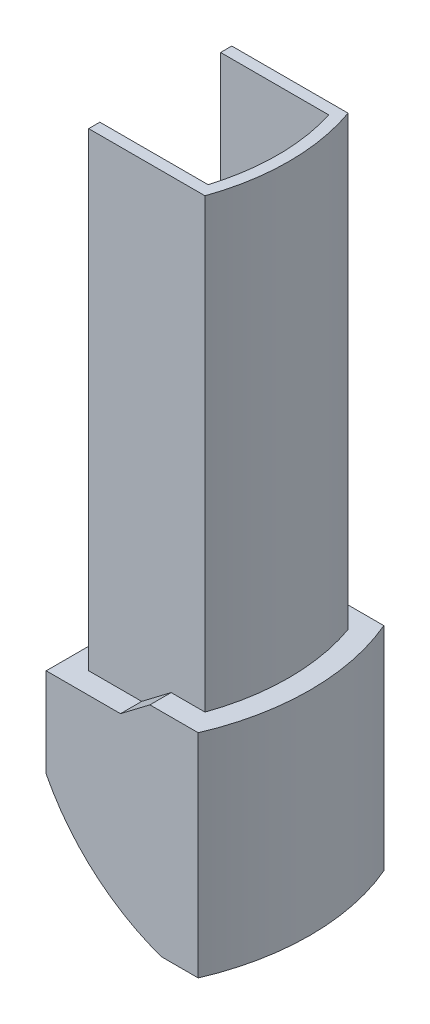
ISO-10303-21;
HEADER;
FILE_DESCRIPTION(('STEP AP214'),'2;1');
FILE_NAME('part.step','',(''),(''),'','','');
FILE_SCHEMA(('AUTOMOTIVE_DESIGN { 1 0 10303 214 1 1 1 1 }'));
ENDSEC;
DATA;
#1=APPLICATION_CONTEXT('core data for automotive mechanical design processes');
#2=APPLICATION_PROTOCOL_DEFINITION('international standard','automotive_design',2000,#1);
#3=PRODUCT_CONTEXT('',#1,'mechanical');
#4=PRODUCT('Part','Part','',(#3));
#5=PRODUCT_RELATED_PRODUCT_CATEGORY('part','',(#4));
#6=PRODUCT_DEFINITION_FORMATION('','',#4);
#7=PRODUCT_DEFINITION_CONTEXT('part definition',#1,'design');
#8=PRODUCT_DEFINITION('design','',#6,#7);
#9=PRODUCT_DEFINITION_SHAPE('','',#8);
#10=(LENGTH_UNIT() NAMED_UNIT(*) SI_UNIT(.MILLI.,.METRE.));
#11=(NAMED_UNIT(*) PLANE_ANGLE_UNIT() SI_UNIT($,.RADIAN.));
#12=(NAMED_UNIT(*) SI_UNIT($,.STERADIAN.) SOLID_ANGLE_UNIT());
#13=UNCERTAINTY_MEASURE_WITH_UNIT(LENGTH_MEASURE(1.E-05),#10,'distance_accuracy_value','');
#14=(GEOMETRIC_REPRESENTATION_CONTEXT(3) GLOBAL_UNCERTAINTY_ASSIGNED_CONTEXT((#13)) GLOBAL_UNIT_ASSIGNED_CONTEXT((#10,
#11,#12)) REPRESENTATION_CONTEXT('',''));
#15=CARTESIAN_POINT('',(0.,0.,0.));
#16=DIRECTION('',(0.,0.,1.));
#17=DIRECTION('',(1.,0.,0.));
#18=AXIS2_PLACEMENT_3D('',#15,#16,#17);
#19=CARTESIAN_POINT('',(0.,19.,16.6));
#20=DIRECTION('',(0.,-1.,0.));
#21=DIRECTION('',(0.,0.,-1.));
#22=AXIS2_PLACEMENT_3D('',#19,#20,#21);
#23=PLANE('',#22);
#24=DIRECTION('',(1.,0.,0.));
#25=VECTOR('',#24,1.);
#26=CARTESIAN_POINT('',(-12.4,19.,2.9));
#27=LINE('',#26,#25);
#28=CARTESIAN_POINT('',(-6.02226363125045,19.,2.9));
#29=VERTEX_POINT('',#28);
#30=CARTESIAN_POINT('',(-3.71899684960306,19.,2.9));
#31=VERTEX_POINT('',#30);
#32=EDGE_CURVE('E371',#29,#31,#27,.T.);
#33=ORIENTED_EDGE('',*,*,#32,.F.);
#34=DIRECTION('',(0.,0.,-1.));
#35=VECTOR('',#34,1.);
#36=CARTESIAN_POINT('',(-6.02226363125045,19.,16.6));
#37=LINE('',#36,#35);
#38=CARTESIAN_POINT('',(-6.02226363125045,19.,13.7));
#39=VERTEX_POINT('',#38);
#40=EDGE_CURVE('E66',#39,#29,#37,.T.);
#41=ORIENTED_EDGE('',*,*,#40,.F.);
#42=DIRECTION('',(-1.,0.,0.));
#43=VECTOR('',#42,1.);
#44=CARTESIAN_POINT('',(-12.4,19.,13.7));
#45=LINE('',#44,#43);
#46=CARTESIAN_POINT('',(-3.71899684960306,19.,13.7));
#47=VERTEX_POINT('',#46);
#48=EDGE_CURVE('E79',#47,#39,#45,.T.);
#49=ORIENTED_EDGE('',*,*,#48,.F.);
#50=CARTESIAN_POINT('',(-21.1117647058824,19.,8.3));
#51=DIRECTION('',(0.,-1.,0.));
#52=DIRECTION('',(0.,0.,-1.));
#53=AXIS2_PLACEMENT_3D('',#50,#51,#52);
#54=CIRCLE('',#53,18.2117647058824);
#55=EDGE_CURVE('E74',#31,#47,#54,.T.);
#56=ORIENTED_EDGE('',*,*,#55,.F.);
#57=EDGE_LOOP('',(#33,#41,#49,#56));
#58=FACE_BOUND('',#57,.T.);
#59=ADVANCED_FACE('F59',(#58),#23,.F.);
#60=DIRECTION('',(1.,0.,0.));
#61=VECTOR('',#60,1.);
#62=CARTESIAN_POINT('',(-13.4,19.,14.7));
#63=LINE('',#62,#61);
#64=CARTESIAN_POINT('',(-6.02226363125045,19.,14.7));
#65=VERTEX_POINT('',#64);
#66=CARTESIAN_POINT('',(-2.99735323009361,19.,14.7));
#67=VERTEX_POINT('',#66);
#68=EDGE_CURVE('E234',#65,#67,#63,.T.);
#69=ORIENTED_EDGE('',*,*,#68,.F.);
#70=CARTESIAN_POINT('',(-6.02226363125045,19.,16.6));
#71=VERTEX_POINT('',#70);
#72=EDGE_CURVE('E12',#71,#65,#37,.T.);
#73=ORIENTED_EDGE('',*,*,#72,.F.);
#74=DIRECTION('',(-1.,0.,0.));
#75=VECTOR('',#74,1.);
#76=CARTESIAN_POINT('',(0.,19.,16.6));
#77=LINE('',#76,#75);
#78=CARTESIAN_POINT('',(-1.7,19.,16.6));
#79=VERTEX_POINT('',#78);
#80=EDGE_CURVE('E287',#79,#71,#77,.T.);
#81=ORIENTED_EDGE('',*,*,#80,.F.);
#82=CARTESIAN_POINT('',(-21.1117647058824,19.,8.3));
#83=DIRECTION('',(0.,-1.,0.));
#84=DIRECTION('',(1.,0.,0.));
#85=AXIS2_PLACEMENT_3D('',#82,#83,#84);
#86=CIRCLE('',#85,21.1117647058824);
#87=CARTESIAN_POINT('',(-1.7,19.,0.));
#88=VERTEX_POINT('',#87);
#89=EDGE_CURVE('E281',#79,#88,#86,.F.);
#90=ORIENTED_EDGE('',*,*,#89,.T.);
#91=DIRECTION('',(-1.,0.,0.));
#92=VECTOR('',#91,1.);
#93=CARTESIAN_POINT('',(0.,19.,0.));
#94=LINE('',#93,#92);
#95=CARTESIAN_POINT('',(-6.02226363125045,19.,0.));
#96=VERTEX_POINT('',#95);
#97=EDGE_CURVE('E286',#88,#96,#94,.T.);
#98=ORIENTED_EDGE('',*,*,#97,.T.);
#99=CARTESIAN_POINT('',(-6.02226363125045,19.,1.9));
#100=VERTEX_POINT('',#99);
#101=EDGE_CURVE('E67',#100,#96,#37,.T.);
#102=ORIENTED_EDGE('',*,*,#101,.F.);
#103=DIRECTION('',(-1.,0.,0.));
#104=VECTOR('',#103,1.);
#105=CARTESIAN_POINT('',(-13.4,19.,1.9));
#106=LINE('',#105,#104);
#107=CARTESIAN_POINT('',(-2.99735323009361,19.,1.9));
#108=VERTEX_POINT('',#107);
#109=EDGE_CURVE('E231',#108,#100,#106,.T.);
#110=ORIENTED_EDGE('',*,*,#109,.F.);
#111=CARTESIAN_POINT('',(-21.1117647058824,19.,8.3));
#112=DIRECTION('',(0.,-1.,0.));
#113=DIRECTION('',(0.,0.,-1.));
#114=AXIS2_PLACEMENT_3D('',#111,#112,#113);
#115=CIRCLE('',#114,19.2117647058824);
#116=EDGE_CURVE('E229',#67,#108,#115,.F.);
#117=ORIENTED_EDGE('',*,*,#116,.F.);
#118=EDGE_LOOP('',(#69,#73,#81,#90,#98,#102,#110,#117));
#119=FACE_BOUND('',#118,.T.);
#120=ADVANCED_FACE('F420',(#119),#23,.F.);
#121=CARTESIAN_POINT('',(-6.02226363125045,19.,16.6));
#122=DIRECTION('',(0.604787850586395,-0.79638662456315,0.));
#123=DIRECTION('',(0.796386624563151,0.604787850586395,0.));
#124=AXIS2_PLACEMENT_3D('',#121,#122,#123);
#125=PLANE('',#124);
#126=DIRECTION('',(0.796386624563151,0.604787850586395,0.));
#127=VECTOR('',#126,1.);
#128=CARTESIAN_POINT('',(-19.219443361661,8.97786537746597,2.9));
#129=LINE('',#128,#127);
#130=CARTESIAN_POINT('',(-8.6558701886275,17.,2.9));
#131=VERTEX_POINT('',#130);
#132=EDGE_CURVE('E374',#131,#29,#129,.T.);
#133=ORIENTED_EDGE('',*,*,#132,.F.);
#134=DIRECTION('',(0.,0.,-1.));
#135=VECTOR('',#134,1.);
#136=CARTESIAN_POINT('',(-8.6558701886275,17.,16.6));
#137=LINE('',#136,#135);
#138=CARTESIAN_POINT('',(-8.6558701886275,17.,13.7));
#139=VERTEX_POINT('',#138);
#140=EDGE_CURVE('E325',#139,#131,#137,.T.);
#141=ORIENTED_EDGE('',*,*,#140,.F.);
#142=DIRECTION('',(-0.796386624563151,-0.604787850586395,0.));
#143=VECTOR('',#142,1.);
#144=CARTESIAN_POINT('',(-19.219443361661,8.97786537746597,13.7));
#145=LINE('',#144,#143);
#146=EDGE_CURVE('E369',#39,#139,#145,.T.);
#147=ORIENTED_EDGE('',*,*,#146,.F.);
#148=ORIENTED_EDGE('',*,*,#40,.T.);
#149=EDGE_LOOP('',(#133,#141,#147,#148));
#150=FACE_BOUND('',#149,.T.);
#151=ADVANCED_FACE('F399',(#150),#125,.F.);
#152=DIRECTION('',(0.796386624563151,0.604787850586395,0.));
#153=VECTOR('',#152,1.);
#154=CARTESIAN_POINT('',(-19.8536750174441,8.49622042256067,14.7));
#155=LINE('',#154,#153);
#156=CARTESIAN_POINT('',(-8.6558701886275,17.,14.7));
#157=VERTEX_POINT('',#156);
#158=EDGE_CURVE('E360',#157,#65,#155,.T.);
#159=ORIENTED_EDGE('',*,*,#158,.F.);
#160=CARTESIAN_POINT('',(-8.6558701886275,17.,16.6));
#161=VERTEX_POINT('',#160);
#162=EDGE_CURVE('E323',#161,#157,#137,.T.);
#163=ORIENTED_EDGE('',*,*,#162,.F.);
#164=DIRECTION('',(-0.796386624563151,-0.604787850586395,0.));
#165=VECTOR('',#164,1.);
#166=CARTESIAN_POINT('',(-6.02226363125045,19.,16.6));
#167=LINE('',#166,#165);
#168=EDGE_CURVE('E289',#71,#161,#167,.T.);
#169=ORIENTED_EDGE('',*,*,#168,.F.);
#170=ORIENTED_EDGE('',*,*,#72,.T.);
#171=EDGE_LOOP('',(#159,#163,#169,#170));
#172=FACE_BOUND('',#171,.T.);
#173=ADVANCED_FACE('F358',(#172),#125,.F.);
#174=DIRECTION('',(-0.796386624563151,-0.604787850586395,0.));
#175=VECTOR('',#174,1.);
#176=CARTESIAN_POINT('',(-19.8536750174441,8.49622042256067,1.9));
#177=LINE('',#176,#175);
#178=CARTESIAN_POINT('',(-8.6558701886275,17.,1.9));
#179=VERTEX_POINT('',#178);
#180=EDGE_CURVE('E228',#100,#179,#177,.T.);
#181=ORIENTED_EDGE('',*,*,#180,.F.);
#182=ORIENTED_EDGE('',*,*,#101,.T.);
#183=DIRECTION('',(-0.796386624563151,-0.604787850586395,0.));
#184=VECTOR('',#183,1.);
#185=CARTESIAN_POINT('',(-6.02226363125045,19.,0.));
#186=LINE('',#185,#184);
#187=CARTESIAN_POINT('',(-8.6558701886275,17.,0.));
#188=VERTEX_POINT('',#187);
#189=EDGE_CURVE('E304',#96,#188,#186,.T.);
#190=ORIENTED_EDGE('',*,*,#189,.T.);
#191=EDGE_CURVE('E322',#179,#188,#137,.T.);
#192=ORIENTED_EDGE('',*,*,#191,.F.);
#193=EDGE_LOOP('',(#181,#182,#190,#192));
#194=FACE_BOUND('',#193,.T.);
#195=ADVANCED_FACE('F334',(#194),#125,.F.);
#196=CARTESIAN_POINT('',(-8.6558701886275,17.,16.6));
#197=DIRECTION('',(0.,-1.,0.));
#198=DIRECTION('',(0.,0.,-1.));
#199=AXIS2_PLACEMENT_3D('',#196,#197,#198);
#200=PLANE('',#199);
#201=DIRECTION('',(-1.,0.,0.));
#202=VECTOR('',#201,1.);
#203=CARTESIAN_POINT('',(-12.4,17.,13.7));
#204=LINE('',#203,#202);
#205=CARTESIAN_POINT('',(-12.4,17.,13.7));
#206=VERTEX_POINT('',#205);
#207=EDGE_CURVE('E376',#139,#206,#204,.T.);
#208=ORIENTED_EDGE('',*,*,#207,.F.);
#209=ORIENTED_EDGE('',*,*,#140,.T.);
#210=DIRECTION('',(1.,0.,0.));
#211=VECTOR('',#210,1.);
#212=CARTESIAN_POINT('',(-12.4,17.,2.9));
#213=LINE('',#212,#211);
#214=CARTESIAN_POINT('',(-12.4,17.,2.9));
#215=VERTEX_POINT('',#214);
#216=EDGE_CURVE('E388',#215,#131,#213,.T.);
#217=ORIENTED_EDGE('',*,*,#216,.F.);
#218=DIRECTION('',(1.,0.,0.));
#219=VECTOR('',#218,1.);
#220=CARTESIAN_POINT('',(-12.4,17.,2.9));
#221=LINE('',#220,#219);
#222=CARTESIAN_POINT('',(-13.4,17.,2.9));
#223=VERTEX_POINT('',#222);
#224=EDGE_CURVE('E208',#223,#215,#221,.T.);
#225=ORIENTED_EDGE('',*,*,#224,.F.);
#226=DIRECTION('',(0.,0.,1.));
#227=VECTOR('',#226,1.);
#228=CARTESIAN_POINT('',(-13.4,17.,1.9));
#229=LINE('',#228,#227);
#230=CARTESIAN_POINT('',(-13.4,17.,1.9));
#231=VERTEX_POINT('',#230);
#232=EDGE_CURVE('E201',#231,#223,#229,.T.);
#233=ORIENTED_EDGE('',*,*,#232,.F.);
#234=DIRECTION('',(-1.,0.,0.));
#235=VECTOR('',#234,1.);
#236=CARTESIAN_POINT('',(-13.4,17.,1.9));
#237=LINE('',#236,#235);
#238=EDGE_CURVE('E205',#179,#231,#237,.T.);
#239=ORIENTED_EDGE('',*,*,#238,.F.);
#240=ORIENTED_EDGE('',*,*,#191,.T.);
#241=DIRECTION('',(-1.,0.,0.));
#242=VECTOR('',#241,1.);
#243=CARTESIAN_POINT('',(-8.6558701886275,17.,0.));
#244=LINE('',#243,#242);
#245=CARTESIAN_POINT('',(-15.3,17.,0.));
#246=VERTEX_POINT('',#245);
#247=EDGE_CURVE('E307',#188,#246,#244,.T.);
#248=ORIENTED_EDGE('',*,*,#247,.T.);
#249=DIRECTION('',(0.,0.,-1.));
#250=VECTOR('',#249,1.);
#251=CARTESIAN_POINT('',(-15.3,17.,16.6));
#252=LINE('',#251,#250);
#253=CARTESIAN_POINT('',(-15.3,17.,16.6));
#254=VERTEX_POINT('',#253);
#255=EDGE_CURVE('E320',#254,#246,#252,.T.);
#256=ORIENTED_EDGE('',*,*,#255,.F.);
#257=DIRECTION('',(-1.,0.,0.));
#258=VECTOR('',#257,1.);
#259=CARTESIAN_POINT('',(-8.6558701886275,17.,16.6));
#260=LINE('',#259,#258);
#261=EDGE_CURVE('E292',#161,#254,#260,.T.);
#262=ORIENTED_EDGE('',*,*,#261,.F.);
#263=ORIENTED_EDGE('',*,*,#162,.T.);
#264=DIRECTION('',(1.,0.,0.));
#265=VECTOR('',#264,1.);
#266=CARTESIAN_POINT('',(-13.4,17.,14.7));
#267=LINE('',#266,#265);
#268=CARTESIAN_POINT('',(-13.4,17.,14.7));
#269=VERTEX_POINT('',#268);
#270=EDGE_CURVE('E363',#269,#157,#267,.T.);
#271=ORIENTED_EDGE('',*,*,#270,.F.);
#272=DIRECTION('',(0.,0.,1.));
#273=VECTOR('',#272,1.);
#274=CARTESIAN_POINT('',(-13.4,17.,13.7));
#275=LINE('',#274,#273);
#276=CARTESIAN_POINT('',(-13.4,17.,13.7));
#277=VERTEX_POINT('',#276);
#278=EDGE_CURVE('E365',#277,#269,#275,.T.);
#279=ORIENTED_EDGE('',*,*,#278,.F.);
#280=DIRECTION('',(-1.,0.,0.));
#281=VECTOR('',#280,1.);
#282=CARTESIAN_POINT('',(-12.4,17.,13.7));
#283=LINE('',#282,#281);
#284=EDGE_CURVE('E377',#206,#277,#283,.T.);
#285=ORIENTED_EDGE('',*,*,#284,.F.);
#286=EDGE_LOOP('',(#208,#209,#217,#225,#233,#239,#240,#248,#256,#262,#263,#271,#279,#285));
#287=FACE_BOUND('',#286,.T.);
#288=ADVANCED_FACE('F203',(#287),#200,.F.);
#289=CARTESIAN_POINT('',(0.,0.,16.6));
#290=DIRECTION('',(0.,1.,0.));
#291=DIRECTION('',(-1.,0.,0.));
#292=AXIS2_PLACEMENT_3D('',#289,#290,#291);
#293=PLANE('',#292);
#294=DIRECTION('',(1.,0.,0.));
#295=VECTOR('',#294,1.);
#296=CARTESIAN_POINT('',(0.,0.,0.));
#297=LINE('',#296,#295);
#298=CARTESIAN_POINT('',(-5.,0.,0.));
#299=VERTEX_POINT('',#298);
#300=CARTESIAN_POINT('',(-1.7,0.,0.));
#301=VERTEX_POINT('',#300);
#302=EDGE_CURVE('E290',#299,#301,#297,.T.);
#303=ORIENTED_EDGE('',*,*,#302,.T.);
#304=CARTESIAN_POINT('',(-21.1117647058824,0.,8.3));
#305=DIRECTION('',(0.,-1.,0.));
#306=DIRECTION('',(1.,0.,0.));
#307=AXIS2_PLACEMENT_3D('',#304,#305,#306);
#308=CIRCLE('',#307,21.1117647058824);
#309=CARTESIAN_POINT('',(-1.7,0.,16.6));
#310=VERTEX_POINT('',#309);
#311=EDGE_CURVE('E280',#310,#301,#308,.F.);
#312=ORIENTED_EDGE('',*,*,#311,.F.);
#313=DIRECTION('',(1.,0.,0.));
#314=VECTOR('',#313,1.);
#315=CARTESIAN_POINT('',(0.,0.,16.6));
#316=LINE('',#315,#314);
#317=CARTESIAN_POINT('',(-5.,0.,16.6));
#318=VERTEX_POINT('',#317);
#319=EDGE_CURVE('E298',#318,#310,#316,.T.);
#320=ORIENTED_EDGE('',*,*,#319,.F.);
#321=DIRECTION('',(0.,0.,-1.));
#322=VECTOR('',#321,1.);
#323=CARTESIAN_POINT('',(-5.,0.,16.6));
#324=LINE('',#323,#322);
#325=EDGE_CURVE('E301',#318,#299,#324,.T.);
#326=ORIENTED_EDGE('',*,*,#325,.T.);
#327=EDGE_LOOP('',(#303,#312,#320,#326));
#328=FACE_BOUND('',#327,.T.);
#329=ADVANCED_FACE('F425',(#328),#293,.F.);
#330=CARTESIAN_POINT('',(-15.3,17.,16.6));
#331=DIRECTION('',(1.,0.,0.));
#332=DIRECTION('',(0.,1.,0.));
#333=AXIS2_PLACEMENT_3D('',#330,#331,#332);
#334=PLANE('',#333);
#335=DIRECTION('',(0.,-1.,0.));
#336=VECTOR('',#335,1.);
#337=CARTESIAN_POINT('',(-15.3,17.,0.));
#338=LINE('',#337,#336);
#339=CARTESIAN_POINT('',(-15.3,9.,0.));
#340=VERTEX_POINT('',#339);
#341=EDGE_CURVE('E309',#246,#340,#338,.T.);
#342=ORIENTED_EDGE('',*,*,#341,.T.);
#343=DIRECTION('',(0.,0.,-1.));
#344=VECTOR('',#343,1.);
#345=CARTESIAN_POINT('',(-15.3,9.,16.6));
#346=LINE('',#345,#344);
#347=CARTESIAN_POINT('',(-15.3,9.,16.6));
#348=VERTEX_POINT('',#347);
#349=EDGE_CURVE('E317',#348,#340,#346,.T.);
#350=ORIENTED_EDGE('',*,*,#349,.F.);
#351=DIRECTION('',(0.,-1.,0.));
#352=VECTOR('',#351,1.);
#353=CARTESIAN_POINT('',(-15.3,17.,16.6));
#354=LINE('',#353,#352);
#355=EDGE_CURVE('E294',#254,#348,#354,.T.);
#356=ORIENTED_EDGE('',*,*,#355,.F.);
#357=ORIENTED_EDGE('',*,*,#255,.T.);
#358=EDGE_LOOP('',(#342,#350,#356,#357));
#359=FACE_BOUND('',#358,.T.);
#360=ADVANCED_FACE('F344',(#359),#334,.F.);
#361=CARTESIAN_POINT('',(1.18862435892284,17.4764256552117,16.6));
#362=DIRECTION('',(0.,0.,-1.));
#363=DIRECTION('',(-1.,0.,0.));
#364=AXIS2_PLACEMENT_3D('',#361,#362,#363);
#365=CYLINDRICAL_SURFACE('',#364,18.539809199072);
#366=CARTESIAN_POINT('',(1.18862435892284,17.4764256552117,0.));
#367=DIRECTION('',(0.,0.,1.));
#368=DIRECTION('',(-1.,0.,0.));
#369=AXIS2_PLACEMENT_3D('',#366,#367,#368);
#370=CIRCLE('',#369,18.539809199072);
#371=EDGE_CURVE('E311',#340,#299,#370,.T.);
#372=ORIENTED_EDGE('',*,*,#371,.T.);
#373=ORIENTED_EDGE('',*,*,#325,.F.);
#374=CARTESIAN_POINT('',(1.18862435892284,17.4764256552117,16.6));
#375=DIRECTION('',(0.,0.,1.));
#376=DIRECTION('',(-1.,0.,0.));
#377=AXIS2_PLACEMENT_3D('',#374,#375,#376);
#378=CIRCLE('',#377,18.539809199072);
#379=EDGE_CURVE('E296',#348,#318,#378,.T.);
#380=ORIENTED_EDGE('',*,*,#379,.F.);
#381=ORIENTED_EDGE('',*,*,#349,.T.);
#382=EDGE_LOOP('',(#372,#373,#380,#381));
#383=FACE_BOUND('',#382,.T.);
#384=ADVANCED_FACE('F348',(#383),#365,.T.);
#385=CARTESIAN_POINT('',(1.18862435892284,17.4764256552117,16.6));
#386=DIRECTION('',(0.,0.,-1.));
#387=DIRECTION('',(-1.,0.,0.));
#388=AXIS2_PLACEMENT_3D('',#385,#386,#387);
#389=PLANE('',#388);
#390=ORIENTED_EDGE('',*,*,#319,.T.);
#391=DIRECTION('',(0.,-1.,0.));
#392=VECTOR('',#391,1.);
#393=CARTESIAN_POINT('',(-1.7,19.,16.6));
#394=LINE('',#393,#392);
#395=EDGE_CURVE('E283',#79,#310,#394,.T.);
#396=ORIENTED_EDGE('',*,*,#395,.F.);
#397=ORIENTED_EDGE('',*,*,#80,.T.);
#398=ORIENTED_EDGE('',*,*,#168,.T.);
#399=ORIENTED_EDGE('',*,*,#261,.T.);
#400=ORIENTED_EDGE('',*,*,#355,.T.);
#401=ORIENTED_EDGE('',*,*,#379,.T.);
#402=EDGE_LOOP('',(#390,#396,#397,#398,#399,#400,#401));
#403=FACE_BOUND('',#402,.T.);
#404=ADVANCED_FACE('F352',(#403),#389,.F.);
#405=CARTESIAN_POINT('',(1.18862435892284,17.4764256552117,0.));
#406=DIRECTION('',(0.,0.,-1.));
#407=DIRECTION('',(-1.,0.,0.));
#408=AXIS2_PLACEMENT_3D('',#405,#406,#407);
#409=PLANE('',#408);
#410=DIRECTION('',(0.,-1.,0.));
#411=VECTOR('',#410,1.);
#412=CARTESIAN_POINT('',(-1.7,19.,0.));
#413=LINE('',#412,#411);
#414=EDGE_CURVE('E271',#88,#301,#413,.T.);
#415=ORIENTED_EDGE('',*,*,#414,.T.);
#416=ORIENTED_EDGE('',*,*,#302,.F.);
#417=ORIENTED_EDGE('',*,*,#371,.F.);
#418=ORIENTED_EDGE('',*,*,#341,.F.);
#419=ORIENTED_EDGE('',*,*,#247,.F.);
#420=ORIENTED_EDGE('',*,*,#189,.F.);
#421=ORIENTED_EDGE('',*,*,#97,.F.);
#422=EDGE_LOOP('',(#415,#416,#417,#418,#419,#420,#421));
#423=FACE_BOUND('',#422,.T.);
#424=ADVANCED_FACE('F339',(#423),#409,.T.);
#425=CARTESIAN_POINT('',(-21.1117647058824,19.,8.3));
#426=DIRECTION('',(0.,-1.,0.));
#427=DIRECTION('',(1.,0.,0.));
#428=AXIS2_PLACEMENT_3D('',#425,#426,#427);
#429=CYLINDRICAL_SURFACE('',#428,21.1117647058824);
#430=ORIENTED_EDGE('',*,*,#311,.T.);
#431=ORIENTED_EDGE('',*,*,#414,.F.);
#432=ORIENTED_EDGE('',*,*,#89,.F.);
#433=ORIENTED_EDGE('',*,*,#395,.T.);
#434=EDGE_LOOP('',(#430,#431,#432,#433));
#435=FACE_BOUND('',#434,.T.);
#436=ADVANCED_FACE('F426',(#435),#429,.T.);
#437=CARTESIAN_POINT('',(-13.4,59.,1.9));
#438=DIRECTION('',(1.,0.,0.));
#439=DIRECTION('',(0.,0.,-1.));
#440=AXIS2_PLACEMENT_3D('',#437,#438,#439);
#441=PLANE('',#440);
#442=DIRECTION('',(0.,-1.,0.));
#443=VECTOR('',#442,1.);
#444=CARTESIAN_POINT('',(-13.4,59.,1.9));
#445=LINE('',#444,#443);
#446=CARTESIAN_POINT('',(-13.4,59.,1.9));
#447=VERTEX_POINT('',#446);
#448=EDGE_CURVE('E215',#447,#231,#445,.T.);
#449=ORIENTED_EDGE('',*,*,#448,.T.);
#450=ORIENTED_EDGE('',*,*,#232,.T.);
#451=DIRECTION('',(0.,-1.,0.));
#452=VECTOR('',#451,1.);
#453=CARTESIAN_POINT('',(-13.4,59.,2.9));
#454=LINE('',#453,#452);
#455=CARTESIAN_POINT('',(-13.4,59.,2.9));
#456=VERTEX_POINT('',#455);
#457=EDGE_CURVE('E269',#456,#223,#454,.T.);
#458=ORIENTED_EDGE('',*,*,#457,.F.);
#459=DIRECTION('',(0.,0.,1.));
#460=VECTOR('',#459,1.);
#461=CARTESIAN_POINT('',(-13.4,59.,1.9));
#462=LINE('',#461,#460);
#463=EDGE_CURVE('E218',#447,#456,#462,.T.);
#464=ORIENTED_EDGE('',*,*,#463,.F.);
#465=EDGE_LOOP('',(#449,#450,#458,#464));
#466=FACE_BOUND('',#465,.T.);
#467=ADVANCED_FACE('F216',(#466),#441,.F.);
#468=CARTESIAN_POINT('',(-12.4,59.,2.9));
#469=DIRECTION('',(0.,0.,-1.));
#470=DIRECTION('',(-1.,0.,0.));
#471=AXIS2_PLACEMENT_3D('',#468,#469,#470);
#472=PLANE('',#471);
#473=ORIENTED_EDGE('',*,*,#216,.T.);
#474=ORIENTED_EDGE('',*,*,#132,.T.);
#475=ORIENTED_EDGE('',*,*,#32,.T.);
#476=DIRECTION('',(0.,-1.,0.));
#477=VECTOR('',#476,1.);
#478=CARTESIAN_POINT('',(-3.71899684960306,59.,2.9));
#479=LINE('',#478,#477);
#480=CARTESIAN_POINT('',(-3.71899684960306,59.,2.9));
#481=VERTEX_POINT('',#480);
#482=EDGE_CURVE('E267',#481,#31,#479,.T.);
#483=ORIENTED_EDGE('',*,*,#482,.F.);
#484=DIRECTION('',(1.,0.,0.));
#485=VECTOR('',#484,1.);
#486=CARTESIAN_POINT('',(-12.4,59.,2.9));
#487=LINE('',#486,#485);
#488=EDGE_CURVE('E241',#456,#481,#487,.T.);
#489=ORIENTED_EDGE('',*,*,#488,.F.);
#490=ORIENTED_EDGE('',*,*,#457,.T.);
#491=ORIENTED_EDGE('',*,*,#224,.T.);
#492=EDGE_LOOP('',(#473,#474,#475,#483,#489,#490,#491));
#493=FACE_BOUND('',#492,.T.);
#494=ADVANCED_FACE('F393',(#493),#472,.F.);
#495=CARTESIAN_POINT('',(-21.1117647058824,59.,8.3));
#496=DIRECTION('',(0.,-1.,0.));
#497=DIRECTION('',(0.,0.,-1.));
#498=AXIS2_PLACEMENT_3D('',#495,#496,#497);
#499=CYLINDRICAL_SURFACE('',#498,18.2117647058824);
#500=ORIENTED_EDGE('',*,*,#482,.T.);
#501=ORIENTED_EDGE('',*,*,#55,.T.);
#502=DIRECTION('',(0.,-1.,0.));
#503=VECTOR('',#502,1.);
#504=CARTESIAN_POINT('',(-3.71899684960306,59.,13.7));
#505=LINE('',#504,#503);
#506=CARTESIAN_POINT('',(-3.71899684960306,59.,13.7));
#507=VERTEX_POINT('',#506);
#508=EDGE_CURVE('E265',#507,#47,#505,.T.);
#509=ORIENTED_EDGE('',*,*,#508,.F.);
#510=CARTESIAN_POINT('',(-21.1117647058824,59.,8.3));
#511=DIRECTION('',(0.,-1.,0.));
#512=DIRECTION('',(0.,0.,-1.));
#513=AXIS2_PLACEMENT_3D('',#510,#511,#512);
#514=CIRCLE('',#513,18.2117647058824);
#515=EDGE_CURVE('E244',#481,#507,#514,.T.);
#516=ORIENTED_EDGE('',*,*,#515,.F.);
#517=EDGE_LOOP('',(#500,#501,#509,#516));
#518=FACE_BOUND('',#517,.T.);
#519=ADVANCED_FACE('F414',(#518),#499,.F.);
#520=CARTESIAN_POINT('',(-12.4,59.,13.7));
#521=DIRECTION('',(0.,0.,1.));
#522=DIRECTION('',(1.,0.,0.));
#523=AXIS2_PLACEMENT_3D('',#520,#521,#522);
#524=PLANE('',#523);
#525=ORIENTED_EDGE('',*,*,#284,.T.);
#526=DIRECTION('',(0.,-1.,0.));
#527=VECTOR('',#526,1.);
#528=CARTESIAN_POINT('',(-13.4,59.,13.7));
#529=LINE('',#528,#527);
#530=CARTESIAN_POINT('',(-13.4,59.,13.7));
#531=VERTEX_POINT('',#530);
#532=EDGE_CURVE('E262',#531,#277,#529,.T.);
#533=ORIENTED_EDGE('',*,*,#532,.F.);
#534=DIRECTION('',(-1.,0.,0.));
#535=VECTOR('',#534,1.);
#536=CARTESIAN_POINT('',(-12.4,59.,13.7));
#537=LINE('',#536,#535);
#538=EDGE_CURVE('E246',#507,#531,#537,.T.);
#539=ORIENTED_EDGE('',*,*,#538,.F.);
#540=ORIENTED_EDGE('',*,*,#508,.T.);
#541=ORIENTED_EDGE('',*,*,#48,.T.);
#542=ORIENTED_EDGE('',*,*,#146,.T.);
#543=ORIENTED_EDGE('',*,*,#207,.T.);
#544=EDGE_LOOP('',(#525,#533,#539,#540,#541,#542,#543));
#545=FACE_BOUND('',#544,.T.);
#546=ADVANCED_FACE('F401',(#545),#524,.F.);
#547=CARTESIAN_POINT('',(-13.4,59.,13.7));
#548=DIRECTION('',(1.,0.,0.));
#549=DIRECTION('',(0.,0.,-1.));
#550=AXIS2_PLACEMENT_3D('',#547,#548,#549);
#551=PLANE('',#550);
#552=ORIENTED_EDGE('',*,*,#532,.T.);
#553=ORIENTED_EDGE('',*,*,#278,.T.);
#554=DIRECTION('',(0.,-1.,0.));
#555=VECTOR('',#554,1.);
#556=CARTESIAN_POINT('',(-13.4,59.,14.7));
#557=LINE('',#556,#555);
#558=CARTESIAN_POINT('',(-13.4,59.,14.7));
#559=VERTEX_POINT('',#558);
#560=EDGE_CURVE('E259',#559,#269,#557,.T.);
#561=ORIENTED_EDGE('',*,*,#560,.F.);
#562=DIRECTION('',(0.,0.,1.));
#563=VECTOR('',#562,1.);
#564=CARTESIAN_POINT('',(-13.4,59.,13.7));
#565=LINE('',#564,#563);
#566=EDGE_CURVE('E248',#531,#559,#565,.T.);
#567=ORIENTED_EDGE('',*,*,#566,.F.);
#568=EDGE_LOOP('',(#552,#553,#561,#567));
#569=FACE_BOUND('',#568,.T.);
#570=ADVANCED_FACE('F406',(#569),#551,.F.);
#571=CARTESIAN_POINT('',(-13.4,59.,14.7));
#572=DIRECTION('',(0.,0.,-1.));
#573=DIRECTION('',(-1.,0.,0.));
#574=AXIS2_PLACEMENT_3D('',#571,#572,#573);
#575=PLANE('',#574);
#576=ORIENTED_EDGE('',*,*,#560,.T.);
#577=ORIENTED_EDGE('',*,*,#270,.T.);
#578=ORIENTED_EDGE('',*,*,#158,.T.);
#579=ORIENTED_EDGE('',*,*,#68,.T.);
#580=DIRECTION('',(0.,-1.,0.));
#581=VECTOR('',#580,1.);
#582=CARTESIAN_POINT('',(-2.99735323009361,59.,14.7));
#583=LINE('',#582,#581);
#584=CARTESIAN_POINT('',(-2.99735323009361,59.,14.7));
#585=VERTEX_POINT('',#584);
#586=EDGE_CURVE('E256',#585,#67,#583,.T.);
#587=ORIENTED_EDGE('',*,*,#586,.F.);
#588=DIRECTION('',(1.,0.,0.));
#589=VECTOR('',#588,1.);
#590=CARTESIAN_POINT('',(-13.4,59.,14.7));
#591=LINE('',#590,#589);
#592=EDGE_CURVE('E250',#559,#585,#591,.T.);
#593=ORIENTED_EDGE('',*,*,#592,.F.);
#594=EDGE_LOOP('',(#576,#577,#578,#579,#587,#593));
#595=FACE_BOUND('',#594,.T.);
#596=ADVANCED_FACE('F542',(#595),#575,.F.);
#597=CARTESIAN_POINT('',(-21.1117647058824,59.,8.3));
#598=DIRECTION('',(0.,-1.,0.));
#599=DIRECTION('',(0.,0.,-1.));
#600=AXIS2_PLACEMENT_3D('',#597,#598,#599);
#601=CYLINDRICAL_SURFACE('',#600,19.2117647058824);
#602=ORIENTED_EDGE('',*,*,#586,.T.);
#603=ORIENTED_EDGE('',*,*,#116,.T.);
#604=DIRECTION('',(0.,-1.,0.));
#605=VECTOR('',#604,1.);
#606=CARTESIAN_POINT('',(-2.99735323009361,59.,1.9));
#607=LINE('',#606,#605);
#608=CARTESIAN_POINT('',(-2.99735323009361,59.,1.9));
#609=VERTEX_POINT('',#608);
#610=EDGE_CURVE('E221',#609,#108,#607,.T.);
#611=ORIENTED_EDGE('',*,*,#610,.F.);
#612=CARTESIAN_POINT('',(-21.1117647058824,59.,8.3));
#613=DIRECTION('',(0.,1.,0.));
#614=DIRECTION('',(0.,0.,-1.));
#615=AXIS2_PLACEMENT_3D('',#612,#613,#614);
#616=CIRCLE('',#615,19.2117647058824);
#617=EDGE_CURVE('E252',#585,#609,#616,.T.);
#618=ORIENTED_EDGE('',*,*,#617,.F.);
#619=EDGE_LOOP('',(#602,#603,#611,#618));
#620=FACE_BOUND('',#619,.T.);
#621=ADVANCED_FACE('F418',(#620),#601,.T.);
#622=CARTESIAN_POINT('',(-13.4,59.,1.9));
#623=DIRECTION('',(0.,0.,1.));
#624=DIRECTION('',(1.,0.,0.));
#625=AXIS2_PLACEMENT_3D('',#622,#623,#624);
#626=PLANE('',#625);
#627=ORIENTED_EDGE('',*,*,#610,.T.);
#628=ORIENTED_EDGE('',*,*,#109,.T.);
#629=ORIENTED_EDGE('',*,*,#180,.T.);
#630=ORIENTED_EDGE('',*,*,#238,.T.);
#631=ORIENTED_EDGE('',*,*,#448,.F.);
#632=DIRECTION('',(-1.,0.,0.));
#633=VECTOR('',#632,1.);
#634=CARTESIAN_POINT('',(-13.4,59.,1.9));
#635=LINE('',#634,#633);
#636=EDGE_CURVE('E222',#609,#447,#635,.T.);
#637=ORIENTED_EDGE('',*,*,#636,.F.);
#638=EDGE_LOOP('',(#627,#628,#629,#630,#631,#637));
#639=FACE_BOUND('',#638,.T.);
#640=ADVANCED_FACE('F226',(#639),#626,.F.);
#641=CARTESIAN_POINT('',(-21.1117647058824,59.,8.3));
#642=DIRECTION('',(0.,-1.,0.));
#643=DIRECTION('',(0.,0.,-1.));
#644=AXIS2_PLACEMENT_3D('',#641,#642,#643);
#645=PLANE('',#644);
#646=ORIENTED_EDGE('',*,*,#463,.T.);
#647=ORIENTED_EDGE('',*,*,#488,.T.);
#648=ORIENTED_EDGE('',*,*,#515,.T.);
#649=ORIENTED_EDGE('',*,*,#538,.T.);
#650=ORIENTED_EDGE('',*,*,#566,.T.);
#651=ORIENTED_EDGE('',*,*,#592,.T.);
#652=ORIENTED_EDGE('',*,*,#617,.T.);
#653=ORIENTED_EDGE('',*,*,#636,.T.);
#654=EDGE_LOOP('',(#646,#647,#648,#649,#650,#651,#652,#653));
#655=FACE_BOUND('',#654,.T.);
#656=ADVANCED_FACE('F409',(#655),#645,.F.);
#657=CLOSED_SHELL('',(#59,#120,#151,#173,#195,#288,#329,#360,#384,#404,#424,#436,#467,#494,#519,
#546,#570,#596,#621,#640,#656));
#658=MANIFOLD_SOLID_BREP('B2',#657);
#659=ADVANCED_BREP_SHAPE_REPRESENTATION('',(#18,#658),#14);
#660=SHAPE_DEFINITION_REPRESENTATION(#9,#659);
ENDSEC;
END-ISO-10303-21;
